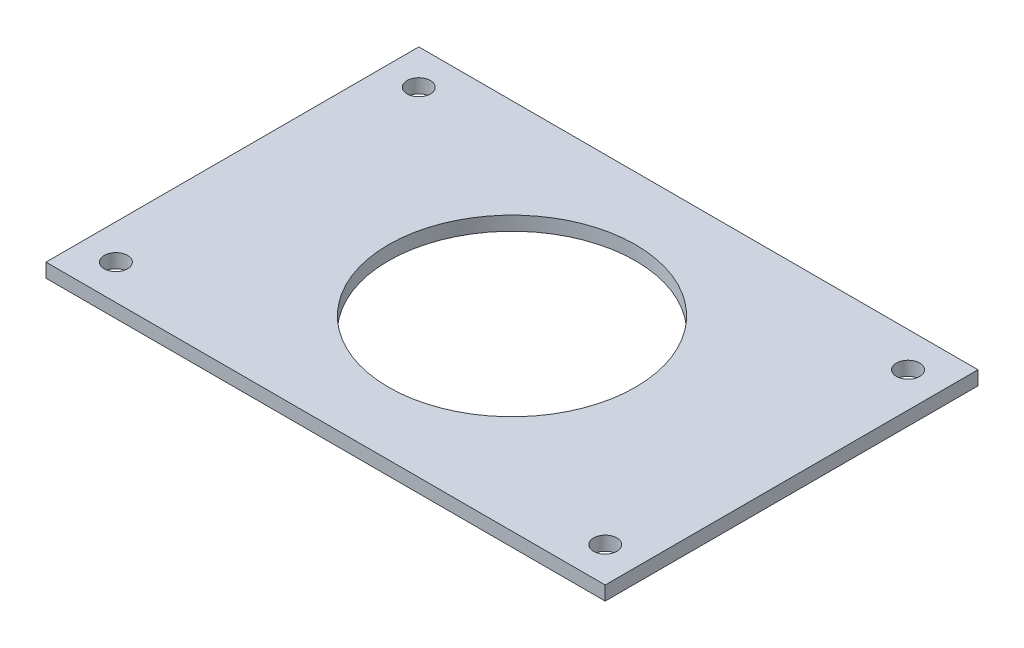
ISO-10303-21;
HEADER;
FILE_DESCRIPTION(('STEP AP214'),'2;1');
FILE_NAME('part.step','',(''),(''),'','','');
FILE_SCHEMA(('AUTOMOTIVE_DESIGN { 1 0 10303 214 1 1 1 1 }'));
ENDSEC;
DATA;
#1=APPLICATION_CONTEXT('core data for automotive mechanical design processes');
#2=APPLICATION_PROTOCOL_DEFINITION('international standard','automotive_design',2000,#1);
#3=PRODUCT_CONTEXT('',#1,'mechanical');
#4=PRODUCT('Part','Part','',(#3));
#5=PRODUCT_RELATED_PRODUCT_CATEGORY('part','',(#4));
#6=PRODUCT_DEFINITION_FORMATION('','',#4);
#7=PRODUCT_DEFINITION_CONTEXT('part definition',#1,'design');
#8=PRODUCT_DEFINITION('design','',#6,#7);
#9=PRODUCT_DEFINITION_SHAPE('','',#8);
#10=(LENGTH_UNIT() NAMED_UNIT(*) SI_UNIT(.MILLI.,.METRE.));
#11=(NAMED_UNIT(*) PLANE_ANGLE_UNIT() SI_UNIT($,.RADIAN.));
#12=(NAMED_UNIT(*) SI_UNIT($,.STERADIAN.) SOLID_ANGLE_UNIT());
#13=UNCERTAINTY_MEASURE_WITH_UNIT(LENGTH_MEASURE(1.E-05),#10,'distance_accuracy_value','');
#14=(GEOMETRIC_REPRESENTATION_CONTEXT(3) GLOBAL_UNCERTAINTY_ASSIGNED_CONTEXT((#13)) GLOBAL_UNIT_ASSIGNED_CONTEXT((#10,
#11,#12)) REPRESENTATION_CONTEXT('',''));
#15=CARTESIAN_POINT('',(0.,0.,0.));
#16=DIRECTION('',(0.,0.,1.));
#17=DIRECTION('',(1.,0.,0.));
#18=AXIS2_PLACEMENT_3D('',#15,#16,#17);
#19=CARTESIAN_POINT('',(0.,0.,0.));
#20=DIRECTION('',(0.,1.,0.));
#21=DIRECTION('',(0.,0.,1.));
#22=AXIS2_PLACEMENT_3D('',#19,#20,#21);
#23=PLANE('',#22);
#24=CARTESIAN_POINT('',(52.5,0.,-32.5));
#25=DIRECTION('',(0.,-1.,0.));
#26=DIRECTION('',(0.,0.,-1.));
#27=AXIS2_PLACEMENT_3D('',#24,#25,#26);
#28=CIRCLE('',#27,2.49999999999999);
#29=CARTESIAN_POINT('',(52.5,0.,-35.));
#30=VERTEX_POINT('',#29);
#31=EDGE_CURVE('E190',#30,#30,#28,.T.);
#32=ORIENTED_EDGE('',*,*,#31,.F.);
#33=EDGE_LOOP('',(#32));
#34=FACE_BOUND('',#33,.T.);
#35=CARTESIAN_POINT('',(-52.5,0.,-32.5));
#36=DIRECTION('',(0.,-1.,0.));
#37=DIRECTION('',(0.,0.,-1.));
#38=AXIS2_PLACEMENT_3D('',#35,#36,#37);
#39=CIRCLE('',#38,2.49999999999999);
#40=CARTESIAN_POINT('',(-52.5,0.,-35.));
#41=VERTEX_POINT('',#40);
#42=EDGE_CURVE('E198',#41,#41,#39,.T.);
#43=ORIENTED_EDGE('',*,*,#42,.F.);
#44=EDGE_LOOP('',(#43));
#45=FACE_BOUND('',#44,.T.);
#46=CARTESIAN_POINT('',(0.,0.,0.));
#47=DIRECTION('',(0.,1.,0.));
#48=DIRECTION('',(0.,0.,1.));
#49=AXIS2_PLACEMENT_3D('',#46,#47,#48);
#50=CIRCLE('',#49,26.5);
#51=CARTESIAN_POINT('',(0.,0.,26.5));
#52=VERTEX_POINT('',#51);
#53=EDGE_CURVE('E115',#52,#52,#50,.T.);
#54=ORIENTED_EDGE('',*,*,#53,.T.);
#55=EDGE_LOOP('',(#54));
#56=FACE_BOUND('',#55,.T.);
#57=DIRECTION('',(0.,0.,1.));
#58=VECTOR('',#57,1.);
#59=CARTESIAN_POINT('',(60.,0.,0.));
#60=LINE('',#59,#58);
#61=CARTESIAN_POINT('',(60.,0.,-40.));
#62=VERTEX_POINT('',#61);
#63=CARTESIAN_POINT('',(60.,0.,40.));
#64=VERTEX_POINT('',#63);
#65=EDGE_CURVE('E119',#62,#64,#60,.T.);
#66=ORIENTED_EDGE('',*,*,#65,.T.);
#67=DIRECTION('',(1.,0.,0.));
#68=VECTOR('',#67,1.);
#69=CARTESIAN_POINT('',(0.,0.,40.));
#70=LINE('',#69,#68);
#71=CARTESIAN_POINT('',(-60.,0.,40.));
#72=VERTEX_POINT('',#71);
#73=EDGE_CURVE('E75',#72,#64,#70,.T.);
#74=ORIENTED_EDGE('',*,*,#73,.F.);
#75=DIRECTION('',(0.,0.,1.));
#76=VECTOR('',#75,1.);
#77=CARTESIAN_POINT('',(-60.,0.,0.));
#78=LINE('',#77,#76);
#79=CARTESIAN_POINT('',(-60.,0.,-40.));
#80=VERTEX_POINT('',#79);
#81=EDGE_CURVE('E125',#80,#72,#78,.T.);
#82=ORIENTED_EDGE('',*,*,#81,.F.);
#83=DIRECTION('',(1.,0.,0.));
#84=VECTOR('',#83,1.);
#85=CARTESIAN_POINT('',(0.,0.,-40.));
#86=LINE('',#85,#84);
#87=EDGE_CURVE('E94',#80,#62,#86,.T.);
#88=ORIENTED_EDGE('',*,*,#87,.T.);
#89=EDGE_LOOP('',(#66,#74,#82,#88));
#90=FACE_BOUND('',#89,.T.);
#91=CARTESIAN_POINT('',(52.5,0.,32.5));
#92=DIRECTION('',(0.,-1.,0.));
#93=DIRECTION('',(0.,0.,-1.));
#94=AXIS2_PLACEMENT_3D('',#91,#92,#93);
#95=CIRCLE('',#94,2.49999999999999);
#96=CARTESIAN_POINT('',(52.5,0.,30.));
#97=VERTEX_POINT('',#96);
#98=EDGE_CURVE('E178',#97,#97,#95,.T.);
#99=ORIENTED_EDGE('',*,*,#98,.F.);
#100=EDGE_LOOP('',(#99));
#101=FACE_BOUND('',#100,.T.);
#102=CARTESIAN_POINT('',(-52.5,0.,32.5));
#103=DIRECTION('',(0.,-1.,0.));
#104=DIRECTION('',(0.,0.,-1.));
#105=AXIS2_PLACEMENT_3D('',#102,#103,#104);
#106=CIRCLE('',#105,2.49999999999999);
#107=CARTESIAN_POINT('',(-52.5,0.,30.));
#108=VERTEX_POINT('',#107);
#109=EDGE_CURVE('E173',#108,#108,#106,.T.);
#110=ORIENTED_EDGE('',*,*,#109,.F.);
#111=EDGE_LOOP('',(#110));
#112=FACE_BOUND('',#111,.T.);
#113=ADVANCED_FACE('F41',(#34,#45,#56,#90,#101,#112),#23,.F.);
#114=CARTESIAN_POINT('',(60.,3.,0.));
#115=DIRECTION('',(1.,0.,0.));
#116=DIRECTION('',(0.,0.,-1.));
#117=AXIS2_PLACEMENT_3D('',#114,#115,#116);
#118=PLANE('',#117);
#119=ORIENTED_EDGE('',*,*,#65,.F.);
#120=DIRECTION('',(0.,-1.,0.));
#121=VECTOR('',#120,1.);
#122=CARTESIAN_POINT('',(60.,3.,-40.));
#123=LINE('',#122,#121);
#124=CARTESIAN_POINT('',(60.,3.,-40.));
#125=VERTEX_POINT('',#124);
#126=EDGE_CURVE('E11',#125,#62,#123,.T.);
#127=ORIENTED_EDGE('',*,*,#126,.F.);
#128=DIRECTION('',(0.,0.,1.));
#129=VECTOR('',#128,1.);
#130=CARTESIAN_POINT('',(60.,3.,0.));
#131=LINE('',#130,#129);
#132=CARTESIAN_POINT('',(60.,3.,40.));
#133=VERTEX_POINT('',#132);
#134=EDGE_CURVE('E105',#125,#133,#131,.T.);
#135=ORIENTED_EDGE('',*,*,#134,.T.);
#136=DIRECTION('',(0.,-1.,0.));
#137=VECTOR('',#136,1.);
#138=CARTESIAN_POINT('',(60.,3.,40.));
#139=LINE('',#138,#137);
#140=EDGE_CURVE('E82',#133,#64,#139,.T.);
#141=ORIENTED_EDGE('',*,*,#140,.T.);
#142=EDGE_LOOP('',(#119,#127,#135,#141));
#143=FACE_BOUND('',#142,.T.);
#144=ADVANCED_FACE('F136',(#143),#118,.T.);
#145=CARTESIAN_POINT('',(0.,3.,-40.));
#146=DIRECTION('',(0.,0.,-1.));
#147=DIRECTION('',(-1.,0.,0.));
#148=AXIS2_PLACEMENT_3D('',#145,#146,#147);
#149=PLANE('',#148);
#150=ORIENTED_EDGE('',*,*,#87,.F.);
#151=DIRECTION('',(0.,-1.,0.));
#152=VECTOR('',#151,1.);
#153=CARTESIAN_POINT('',(-60.,3.,-40.));
#154=LINE('',#153,#152);
#155=CARTESIAN_POINT('',(-60.,3.,-40.));
#156=VERTEX_POINT('',#155);
#157=EDGE_CURVE('E51',#156,#80,#154,.T.);
#158=ORIENTED_EDGE('',*,*,#157,.F.);
#159=DIRECTION('',(1.,0.,0.));
#160=VECTOR('',#159,1.);
#161=CARTESIAN_POINT('',(0.,3.,-40.));
#162=LINE('',#161,#160);
#163=EDGE_CURVE('E92',#156,#125,#162,.T.);
#164=ORIENTED_EDGE('',*,*,#163,.T.);
#165=ORIENTED_EDGE('',*,*,#126,.T.);
#166=EDGE_LOOP('',(#150,#158,#164,#165));
#167=FACE_BOUND('',#166,.T.);
#168=ADVANCED_FACE('F90',(#167),#149,.T.);
#169=CARTESIAN_POINT('',(-60.,3.,0.));
#170=DIRECTION('',(1.,0.,0.));
#171=DIRECTION('',(0.,0.,-1.));
#172=AXIS2_PLACEMENT_3D('',#169,#170,#171);
#173=PLANE('',#172);
#174=ORIENTED_EDGE('',*,*,#81,.T.);
#175=DIRECTION('',(0.,-1.,0.));
#176=VECTOR('',#175,1.);
#177=CARTESIAN_POINT('',(-60.,3.,40.));
#178=LINE('',#177,#176);
#179=CARTESIAN_POINT('',(-60.,3.,40.));
#180=VERTEX_POINT('',#179);
#181=EDGE_CURVE('E98',#180,#72,#178,.T.);
#182=ORIENTED_EDGE('',*,*,#181,.F.);
#183=DIRECTION('',(0.,0.,1.));
#184=VECTOR('',#183,1.);
#185=CARTESIAN_POINT('',(-60.,3.,0.));
#186=LINE('',#185,#184);
#187=EDGE_CURVE('E100',#156,#180,#186,.T.);
#188=ORIENTED_EDGE('',*,*,#187,.F.);
#189=ORIENTED_EDGE('',*,*,#157,.T.);
#190=EDGE_LOOP('',(#174,#182,#188,#189));
#191=FACE_BOUND('',#190,.T.);
#192=ADVANCED_FACE('F101',(#191),#173,.F.);
#193=CARTESIAN_POINT('',(0.,3.,0.));
#194=DIRECTION('',(0.,-1.,0.));
#195=DIRECTION('',(0.,0.,-1.));
#196=AXIS2_PLACEMENT_3D('',#193,#194,#195);
#197=CYLINDRICAL_SURFACE('',#196,26.5);
#198=CARTESIAN_POINT('',(0.,3.,0.));
#199=DIRECTION('',(0.,1.,0.));
#200=DIRECTION('',(0.,0.,1.));
#201=AXIS2_PLACEMENT_3D('',#198,#199,#200);
#202=CIRCLE('',#201,26.5);
#203=CARTESIAN_POINT('',(0.,3.,26.5));
#204=VERTEX_POINT('',#203);
#205=EDGE_CURVE('E109',#204,#204,#202,.T.);
#206=ORIENTED_EDGE('',*,*,#205,.T.);
#207=EDGE_LOOP('',(#206));
#208=FACE_BOUND('',#207,.T.);
#209=ORIENTED_EDGE('',*,*,#53,.F.);
#210=EDGE_LOOP('',(#209));
#211=FACE_BOUND('',#210,.T.);
#212=ADVANCED_FACE('F43',(#208,#211),#197,.F.);
#213=CARTESIAN_POINT('',(0.,3.,40.));
#214=DIRECTION('',(0.,0.,-1.));
#215=DIRECTION('',(-1.,0.,0.));
#216=AXIS2_PLACEMENT_3D('',#213,#214,#215);
#217=PLANE('',#216);
#218=ORIENTED_EDGE('',*,*,#73,.T.);
#219=ORIENTED_EDGE('',*,*,#140,.F.);
#220=DIRECTION('',(1.,0.,0.));
#221=VECTOR('',#220,1.);
#222=CARTESIAN_POINT('',(0.,3.,40.));
#223=LINE('',#222,#221);
#224=EDGE_CURVE('E59',#180,#133,#223,.T.);
#225=ORIENTED_EDGE('',*,*,#224,.F.);
#226=ORIENTED_EDGE('',*,*,#181,.T.);
#227=EDGE_LOOP('',(#218,#219,#225,#226));
#228=FACE_BOUND('',#227,.T.);
#229=ADVANCED_FACE('F134',(#228),#217,.F.);
#230=CARTESIAN_POINT('',(0.,3.,0.));
#231=DIRECTION('',(0.,1.,0.));
#232=DIRECTION('',(0.,0.,1.));
#233=AXIS2_PLACEMENT_3D('',#230,#231,#232);
#234=PLANE('',#233);
#235=CARTESIAN_POINT('',(-52.5,3.,32.5));
#236=DIRECTION('',(0.,1.,0.));
#237=DIRECTION('',(0.,0.,1.));
#238=AXIS2_PLACEMENT_3D('',#235,#236,#237);
#239=CIRCLE('',#238,2.5);
#240=CARTESIAN_POINT('',(-52.5,3.,35.));
#241=VERTEX_POINT('',#240);
#242=EDGE_CURVE('E176',#241,#241,#239,.T.);
#243=ORIENTED_EDGE('',*,*,#242,.F.);
#244=EDGE_LOOP('',(#243));
#245=FACE_BOUND('',#244,.T.);
#246=CARTESIAN_POINT('',(52.5,3.,32.5));
#247=DIRECTION('',(0.,1.,0.));
#248=DIRECTION('',(0.,0.,1.));
#249=AXIS2_PLACEMENT_3D('',#246,#247,#248);
#250=CIRCLE('',#249,2.5);
#251=CARTESIAN_POINT('',(52.5,3.,35.));
#252=VERTEX_POINT('',#251);
#253=EDGE_CURVE('E183',#252,#252,#250,.T.);
#254=ORIENTED_EDGE('',*,*,#253,.F.);
#255=EDGE_LOOP('',(#254));
#256=FACE_BOUND('',#255,.T.);
#257=CARTESIAN_POINT('',(52.5,3.,-32.5));
#258=DIRECTION('',(0.,1.,0.));
#259=DIRECTION('',(0.,0.,1.));
#260=AXIS2_PLACEMENT_3D('',#257,#258,#259);
#261=CIRCLE('',#260,2.5);
#262=CARTESIAN_POINT('',(52.5,3.,-30.));
#263=VERTEX_POINT('',#262);
#264=EDGE_CURVE('E194',#263,#263,#261,.T.);
#265=ORIENTED_EDGE('',*,*,#264,.F.);
#266=EDGE_LOOP('',(#265));
#267=FACE_BOUND('',#266,.T.);
#268=CARTESIAN_POINT('',(-52.5,3.,-32.5));
#269=DIRECTION('',(0.,1.,0.));
#270=DIRECTION('',(0.,0.,1.));
#271=AXIS2_PLACEMENT_3D('',#268,#269,#270);
#272=CIRCLE('',#271,2.5);
#273=CARTESIAN_POINT('',(-52.5,3.,-30.));
#274=VERTEX_POINT('',#273);
#275=EDGE_CURVE('E120',#274,#274,#272,.T.);
#276=ORIENTED_EDGE('',*,*,#275,.F.);
#277=EDGE_LOOP('',(#276));
#278=FACE_BOUND('',#277,.T.);
#279=ORIENTED_EDGE('',*,*,#205,.F.);
#280=EDGE_LOOP('',(#279));
#281=FACE_BOUND('',#280,.T.);
#282=ORIENTED_EDGE('',*,*,#134,.F.);
#283=ORIENTED_EDGE('',*,*,#163,.F.);
#284=ORIENTED_EDGE('',*,*,#187,.T.);
#285=ORIENTED_EDGE('',*,*,#224,.T.);
#286=EDGE_LOOP('',(#282,#283,#284,#285));
#287=FACE_BOUND('',#286,.T.);
#288=ADVANCED_FACE('F104',(#245,#256,#267,#278,#281,#287),#234,.T.);
#289=CARTESIAN_POINT('',(-52.5,0.,-32.5));
#290=DIRECTION('',(0.,-1.,0.));
#291=DIRECTION('',(0.,0.,-1.));
#292=AXIS2_PLACEMENT_3D('',#289,#290,#291);
#293=CYLINDRICAL_SURFACE('',#292,2.5);
#294=ORIENTED_EDGE('',*,*,#42,.T.);
#295=EDGE_LOOP('',(#294));
#296=FACE_BOUND('',#295,.T.);
#297=ORIENTED_EDGE('',*,*,#275,.T.);
#298=EDGE_LOOP('',(#297));
#299=FACE_BOUND('',#298,.T.);
#300=ADVANCED_FACE('F152',(#296,#299),#293,.F.);
#301=CARTESIAN_POINT('',(52.5,0.,-32.5));
#302=DIRECTION('',(0.,-1.,0.));
#303=DIRECTION('',(0.,0.,-1.));
#304=AXIS2_PLACEMENT_3D('',#301,#302,#303);
#305=CYLINDRICAL_SURFACE('',#304,2.5);
#306=ORIENTED_EDGE('',*,*,#31,.T.);
#307=EDGE_LOOP('',(#306));
#308=FACE_BOUND('',#307,.T.);
#309=ORIENTED_EDGE('',*,*,#264,.T.);
#310=EDGE_LOOP('',(#309));
#311=FACE_BOUND('',#310,.T.);
#312=ADVANCED_FACE('F156',(#308,#311),#305,.F.);
#313=CARTESIAN_POINT('',(52.5,0.,32.5));
#314=DIRECTION('',(0.,-1.,0.));
#315=DIRECTION('',(0.,0.,-1.));
#316=AXIS2_PLACEMENT_3D('',#313,#314,#315);
#317=CYLINDRICAL_SURFACE('',#316,2.5);
#318=ORIENTED_EDGE('',*,*,#98,.T.);
#319=EDGE_LOOP('',(#318));
#320=FACE_BOUND('',#319,.T.);
#321=ORIENTED_EDGE('',*,*,#253,.T.);
#322=EDGE_LOOP('',(#321));
#323=FACE_BOUND('',#322,.T.);
#324=ADVANCED_FACE('F160',(#320,#323),#317,.F.);
#325=CARTESIAN_POINT('',(-52.5,0.,32.5));
#326=DIRECTION('',(0.,-1.,0.));
#327=DIRECTION('',(0.,0.,-1.));
#328=AXIS2_PLACEMENT_3D('',#325,#326,#327);
#329=CYLINDRICAL_SURFACE('',#328,2.5);
#330=ORIENTED_EDGE('',*,*,#109,.T.);
#331=EDGE_LOOP('',(#330));
#332=FACE_BOUND('',#331,.T.);
#333=ORIENTED_EDGE('',*,*,#242,.T.);
#334=EDGE_LOOP('',(#333));
#335=FACE_BOUND('',#334,.T.);
#336=ADVANCED_FACE('F164',(#332,#335),#329,.F.);
#337=CLOSED_SHELL('',(#113,#144,#168,#192,#212,#229,#288,#300,#312,#324,#336));
#338=MANIFOLD_SOLID_BREP('B2',#337);
#339=ADVANCED_BREP_SHAPE_REPRESENTATION('',(#18,#338),#14);
#340=SHAPE_DEFINITION_REPRESENTATION(#9,#339);
ENDSEC;
END-ISO-10303-21;
